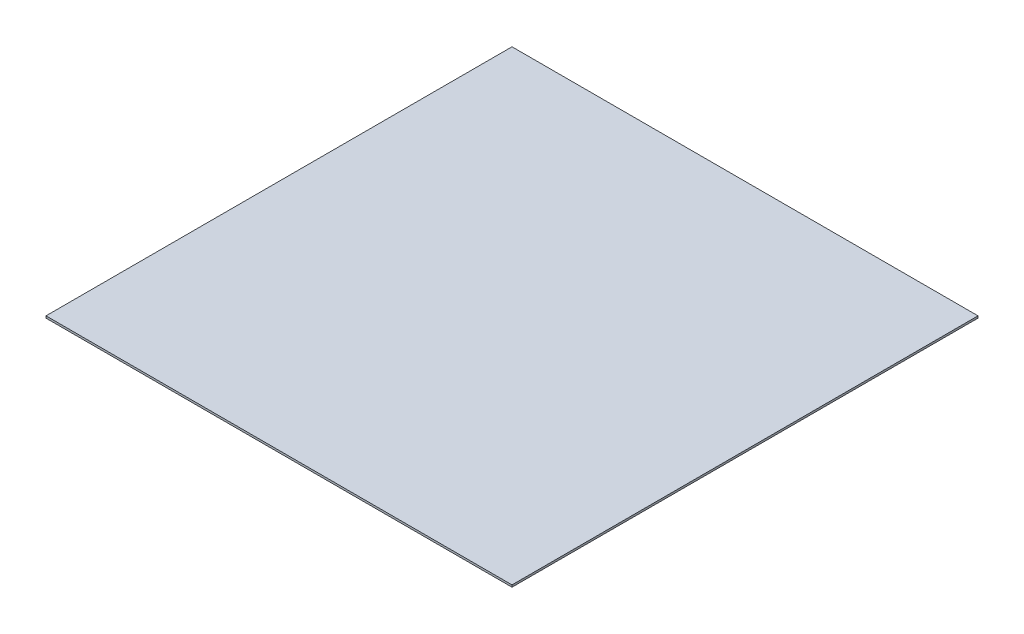
ISO-10303-21;
HEADER;
FILE_DESCRIPTION(('STEP AP214'),'2;1');
FILE_NAME('part.step','',(''),(''),'','','');
FILE_SCHEMA(('AUTOMOTIVE_DESIGN { 1 0 10303 214 1 1 1 1 }'));
ENDSEC;
DATA;
#1=APPLICATION_CONTEXT('core data for automotive mechanical design processes');
#2=APPLICATION_PROTOCOL_DEFINITION('international standard','automotive_design',2000,#1);
#3=PRODUCT_CONTEXT('',#1,'mechanical');
#4=PRODUCT('Part','Part','',(#3));
#5=PRODUCT_RELATED_PRODUCT_CATEGORY('part','',(#4));
#6=PRODUCT_DEFINITION_FORMATION('','',#4);
#7=PRODUCT_DEFINITION_CONTEXT('part definition',#1,'design');
#8=PRODUCT_DEFINITION('design','',#6,#7);
#9=PRODUCT_DEFINITION_SHAPE('','',#8);
#10=(LENGTH_UNIT() NAMED_UNIT(*) SI_UNIT(.MILLI.,.METRE.));
#11=(NAMED_UNIT(*) PLANE_ANGLE_UNIT() SI_UNIT($,.RADIAN.));
#12=(NAMED_UNIT(*) SI_UNIT($,.STERADIAN.) SOLID_ANGLE_UNIT());
#13=UNCERTAINTY_MEASURE_WITH_UNIT(LENGTH_MEASURE(1.E-05),#10,'distance_accuracy_value','');
#14=(GEOMETRIC_REPRESENTATION_CONTEXT(3) GLOBAL_UNCERTAINTY_ASSIGNED_CONTEXT((#13)) GLOBAL_UNIT_ASSIGNED_CONTEXT((#10,
#11,#12)) REPRESENTATION_CONTEXT('',''));
#15=CARTESIAN_POINT('',(0.,0.,0.));
#16=DIRECTION('',(0.,0.,1.));
#17=DIRECTION('',(1.,0.,0.));
#18=AXIS2_PLACEMENT_3D('',#15,#16,#17);
#19=CARTESIAN_POINT('',(149.,1.3,-149.));
#20=DIRECTION('',(-1.,0.,0.));
#21=DIRECTION('',(0.,0.,1.));
#22=AXIS2_PLACEMENT_3D('',#19,#20,#21);
#23=PLANE('',#22);
#24=DIRECTION('',(0.,0.,-1.));
#25=VECTOR('',#24,1.);
#26=CARTESIAN_POINT('',(149.,0.,-149.));
#27=LINE('',#26,#25);
#28=CARTESIAN_POINT('',(149.,0.,149.));
#29=VERTEX_POINT('',#28);
#30=CARTESIAN_POINT('',(149.,0.,-149.));
#31=VERTEX_POINT('',#30);
#32=EDGE_CURVE('E97',#29,#31,#27,.T.);
#33=ORIENTED_EDGE('',*,*,#32,.T.);
#34=DIRECTION('',(0.,-1.,0.));
#35=VECTOR('',#34,1.);
#36=CARTESIAN_POINT('',(149.,1.3,-149.));
#37=LINE('',#36,#35);
#38=CARTESIAN_POINT('',(149.,1.3,-149.));
#39=VERTEX_POINT('',#38);
#40=EDGE_CURVE('E11',#39,#31,#37,.T.);
#41=ORIENTED_EDGE('',*,*,#40,.F.);
#42=DIRECTION('',(0.,0.,-1.));
#43=VECTOR('',#42,1.);
#44=CARTESIAN_POINT('',(149.,1.3,-149.));
#45=LINE('',#44,#43);
#46=CARTESIAN_POINT('',(149.,1.3,149.));
#47=VERTEX_POINT('',#46);
#48=EDGE_CURVE('E85',#47,#39,#45,.T.);
#49=ORIENTED_EDGE('',*,*,#48,.F.);
#50=DIRECTION('',(0.,-1.,0.));
#51=VECTOR('',#50,1.);
#52=CARTESIAN_POINT('',(149.,1.3,149.));
#53=LINE('',#52,#51);
#54=EDGE_CURVE('E93',#47,#29,#53,.T.);
#55=ORIENTED_EDGE('',*,*,#54,.T.);
#56=EDGE_LOOP('',(#33,#41,#49,#55));
#57=FACE_BOUND('',#56,.T.);
#58=ADVANCED_FACE('F34',(#57),#23,.F.);
#59=CARTESIAN_POINT('',(-149.,1.3,-149.));
#60=DIRECTION('',(0.,0.,1.));
#61=DIRECTION('',(1.,0.,0.));
#62=AXIS2_PLACEMENT_3D('',#59,#60,#61);
#63=PLANE('',#62);
#64=DIRECTION('',(-1.,0.,0.));
#65=VECTOR('',#64,1.);
#66=CARTESIAN_POINT('',(-149.,0.,-149.));
#67=LINE('',#66,#65);
#68=CARTESIAN_POINT('',(-149.,0.,-149.));
#69=VERTEX_POINT('',#68);
#70=EDGE_CURVE('E89',#31,#69,#67,.T.);
#71=ORIENTED_EDGE('',*,*,#70,.T.);
#72=DIRECTION('',(0.,-1.,0.));
#73=VECTOR('',#72,1.);
#74=CARTESIAN_POINT('',(-149.,1.3,-149.));
#75=LINE('',#74,#73);
#76=CARTESIAN_POINT('',(-149.,1.3,-149.));
#77=VERTEX_POINT('',#76);
#78=EDGE_CURVE('E42',#77,#69,#75,.T.);
#79=ORIENTED_EDGE('',*,*,#78,.F.);
#80=DIRECTION('',(-1.,0.,0.));
#81=VECTOR('',#80,1.);
#82=CARTESIAN_POINT('',(-149.,1.3,-149.));
#83=LINE('',#82,#81);
#84=EDGE_CURVE('E80',#39,#77,#83,.T.);
#85=ORIENTED_EDGE('',*,*,#84,.F.);
#86=ORIENTED_EDGE('',*,*,#40,.T.);
#87=EDGE_LOOP('',(#71,#79,#85,#86));
#88=FACE_BOUND('',#87,.T.);
#89=ADVANCED_FACE('F88',(#88),#63,.F.);
#90=CARTESIAN_POINT('',(-149.,1.3,-149.));
#91=DIRECTION('',(1.,0.,0.));
#92=DIRECTION('',(0.,0.,-1.));
#93=AXIS2_PLACEMENT_3D('',#90,#91,#92);
#94=PLANE('',#93);
#95=DIRECTION('',(0.,0.,1.));
#96=VECTOR('',#95,1.);
#97=CARTESIAN_POINT('',(-149.,0.,-149.));
#98=LINE('',#97,#96);
#99=CARTESIAN_POINT('',(-149.,0.,149.));
#100=VERTEX_POINT('',#99);
#101=EDGE_CURVE('E67',#69,#100,#98,.T.);
#102=ORIENTED_EDGE('',*,*,#101,.T.);
#103=DIRECTION('',(0.,-1.,0.));
#104=VECTOR('',#103,1.);
#105=CARTESIAN_POINT('',(-149.,1.3,149.));
#106=LINE('',#105,#104);
#107=CARTESIAN_POINT('',(-149.,1.3,149.));
#108=VERTEX_POINT('',#107);
#109=EDGE_CURVE('E90',#108,#100,#106,.T.);
#110=ORIENTED_EDGE('',*,*,#109,.F.);
#111=DIRECTION('',(0.,0.,1.));
#112=VECTOR('',#111,1.);
#113=CARTESIAN_POINT('',(-149.,1.3,-149.));
#114=LINE('',#113,#112);
#115=EDGE_CURVE('E83',#77,#108,#114,.T.);
#116=ORIENTED_EDGE('',*,*,#115,.F.);
#117=ORIENTED_EDGE('',*,*,#78,.T.);
#118=EDGE_LOOP('',(#102,#110,#116,#117));
#119=FACE_BOUND('',#118,.T.);
#120=ADVANCED_FACE('F91',(#119),#94,.F.);
#121=CARTESIAN_POINT('',(-149.,1.3,149.));
#122=DIRECTION('',(0.,0.,-1.));
#123=DIRECTION('',(-1.,0.,0.));
#124=AXIS2_PLACEMENT_3D('',#121,#122,#123);
#125=PLANE('',#124);
#126=DIRECTION('',(1.,0.,0.));
#127=VECTOR('',#126,1.);
#128=CARTESIAN_POINT('',(-149.,0.,149.));
#129=LINE('',#128,#127);
#130=EDGE_CURVE('E73',#100,#29,#129,.T.);
#131=ORIENTED_EDGE('',*,*,#130,.T.);
#132=ORIENTED_EDGE('',*,*,#54,.F.);
#133=DIRECTION('',(1.,0.,0.));
#134=VECTOR('',#133,1.);
#135=CARTESIAN_POINT('',(-149.,1.3,149.));
#136=LINE('',#135,#134);
#137=EDGE_CURVE('E50',#108,#47,#136,.T.);
#138=ORIENTED_EDGE('',*,*,#137,.F.);
#139=ORIENTED_EDGE('',*,*,#109,.T.);
#140=EDGE_LOOP('',(#131,#132,#138,#139));
#141=FACE_BOUND('',#140,.T.);
#142=ADVANCED_FACE('F104',(#141),#125,.F.);
#143=CARTESIAN_POINT('',(0.,1.3,0.));
#144=DIRECTION('',(0.,1.,0.));
#145=DIRECTION('',(0.,0.,1.));
#146=AXIS2_PLACEMENT_3D('',#143,#144,#145);
#147=PLANE('',#146);
#148=ORIENTED_EDGE('',*,*,#48,.T.);
#149=ORIENTED_EDGE('',*,*,#84,.T.);
#150=ORIENTED_EDGE('',*,*,#115,.T.);
#151=ORIENTED_EDGE('',*,*,#137,.T.);
#152=EDGE_LOOP('',(#148,#149,#150,#151));
#153=FACE_BOUND('',#152,.T.);
#154=ADVANCED_FACE('F81',(#153),#147,.T.);
#155=CARTESIAN_POINT('',(0.,0.,0.));
#156=DIRECTION('',(0.,1.,0.));
#157=DIRECTION('',(0.,0.,1.));
#158=AXIS2_PLACEMENT_3D('',#155,#156,#157);
#159=PLANE('',#158);
#160=ORIENTED_EDGE('',*,*,#32,.F.);
#161=ORIENTED_EDGE('',*,*,#130,.F.);
#162=ORIENTED_EDGE('',*,*,#101,.F.);
#163=ORIENTED_EDGE('',*,*,#70,.F.);
#164=EDGE_LOOP('',(#160,#161,#162,#163));
#165=FACE_BOUND('',#164,.T.);
#166=ADVANCED_FACE('F107',(#165),#159,.F.);
#167=CLOSED_SHELL('',(#58,#89,#120,#142,#154,#166));
#168=MANIFOLD_SOLID_BREP('B2',#167);
#169=ADVANCED_BREP_SHAPE_REPRESENTATION('',(#18,#168),#14);
#170=SHAPE_DEFINITION_REPRESENTATION(#9,#169);
ENDSEC;
END-ISO-10303-21;
